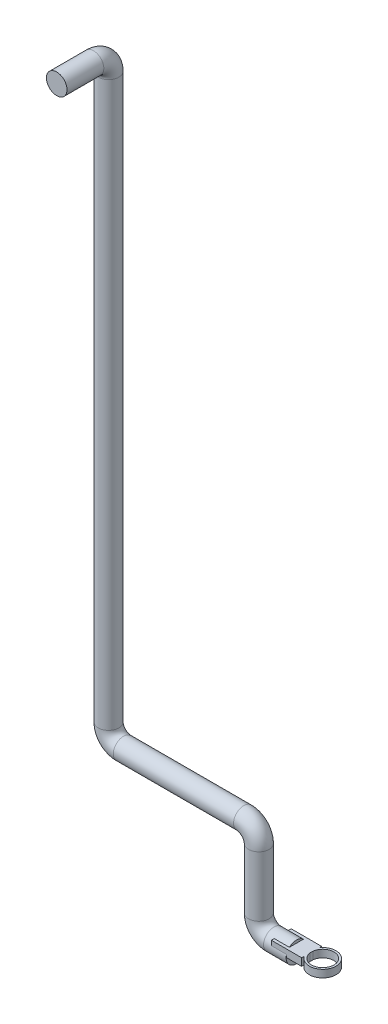
ISO-10303-21;
HEADER;
FILE_DESCRIPTION(('STEP AP214'),'2;1');
FILE_NAME('part.step','',(''),(''),'','','');
FILE_SCHEMA(('AUTOMOTIVE_DESIGN { 1 0 10303 214 1 1 1 1 }'));
ENDSEC;
DATA;
#1=APPLICATION_CONTEXT('core data for automotive mechanical design processes');
#2=APPLICATION_PROTOCOL_DEFINITION('international standard','automotive_design',2000,#1);
#3=PRODUCT_CONTEXT('',#1,'mechanical');
#4=PRODUCT('Part','Part','',(#3));
#5=PRODUCT_RELATED_PRODUCT_CATEGORY('part','',(#4));
#6=PRODUCT_DEFINITION_FORMATION('','',#4);
#7=PRODUCT_DEFINITION_CONTEXT('part definition',#1,'design');
#8=PRODUCT_DEFINITION('design','',#6,#7);
#9=PRODUCT_DEFINITION_SHAPE('','',#8);
#10=(LENGTH_UNIT() NAMED_UNIT(*) SI_UNIT(.MILLI.,.METRE.));
#11=(NAMED_UNIT(*) PLANE_ANGLE_UNIT() SI_UNIT($,.RADIAN.));
#12=(NAMED_UNIT(*) SI_UNIT($,.STERADIAN.) SOLID_ANGLE_UNIT());
#13=UNCERTAINTY_MEASURE_WITH_UNIT(LENGTH_MEASURE(1.E-05),#10,'distance_accuracy_value','');
#14=(GEOMETRIC_REPRESENTATION_CONTEXT(3) GLOBAL_UNCERTAINTY_ASSIGNED_CONTEXT((#13)) GLOBAL_UNIT_ASSIGNED_CONTEXT((#10,
#11,#12)) REPRESENTATION_CONTEXT('',''));
#15=CARTESIAN_POINT('',(0.,0.,0.));
#16=DIRECTION('',(0.,0.,1.));
#17=DIRECTION('',(1.,0.,0.));
#18=AXIS2_PLACEMENT_3D('',#15,#16,#17);
#19=CARTESIAN_POINT('',(20.1474570768367,10.,-13.1948239833502));
#20=DIRECTION('',(-1.,0.,0.));
#21=DIRECTION('',(0.,0.,1.));
#22=AXIS2_PLACEMENT_3D('',#19,#20,#21);
#23=PLANE('',#22);
#24=DIRECTION('',(0.,-1.,0.));
#25=VECTOR('',#24,1.);
#26=CARTESIAN_POINT('',(20.1474570768367,10.,-9.74217306553213));
#27=LINE('',#26,#25);
#28=CARTESIAN_POINT('',(20.1474570768367,0.,-9.74217306553213));
#29=VERTEX_POINT('',#28);
#30=CARTESIAN_POINT('',(20.1474570768367,10.,-9.74217306553213));
#31=VERTEX_POINT('',#30);
#32=EDGE_CURVE('E146',#29,#31,#27,.F.);
#33=ORIENTED_EDGE('',*,*,#32,.F.);
#34=DIRECTION('',(0.,0.,-1.));
#35=VECTOR('',#34,1.);
#36=CARTESIAN_POINT('',(20.1474570768367,0.,-13.1948239833502));
#37=LINE('',#36,#35);
#38=CARTESIAN_POINT('',(20.1474570768367,0.,-13.1948239833502));
#39=VERTEX_POINT('',#38);
#40=EDGE_CURVE('E161',#29,#39,#37,.T.);
#41=ORIENTED_EDGE('',*,*,#40,.T.);
#42=DIRECTION('',(0.,-1.,0.));
#43=VECTOR('',#42,1.);
#44=CARTESIAN_POINT('',(20.1474570768367,10.,-13.1948239833502));
#45=LINE('',#44,#43);
#46=CARTESIAN_POINT('',(20.1474570768367,10.,-13.1948239833502));
#47=VERTEX_POINT('',#46);
#48=EDGE_CURVE('E173',#47,#39,#45,.T.);
#49=ORIENTED_EDGE('',*,*,#48,.F.);
#50=DIRECTION('',(0.,0.,-1.));
#51=VECTOR('',#50,1.);
#52=CARTESIAN_POINT('',(20.1474570768367,10.,-13.1948239833502));
#53=LINE('',#52,#51);
#54=EDGE_CURVE('E139',#31,#47,#53,.T.);
#55=ORIENTED_EDGE('',*,*,#54,.F.);
#56=EDGE_LOOP('',(#33,#41,#49,#55));
#57=FACE_BOUND('',#56,.T.);
#58=ADVANCED_FACE('F34',(#57),#23,.F.);
#59=DIRECTION('',(0.,-1.,0.));
#60=VECTOR('',#59,1.);
#61=CARTESIAN_POINT('',(20.1474570768367,10.,9.74217306553213));
#62=LINE('',#61,#60);
#63=CARTESIAN_POINT('',(20.1474570768367,10.,9.74217306553213));
#64=VERTEX_POINT('',#63);
#65=CARTESIAN_POINT('',(20.1474570768367,0.,9.74217306553213));
#66=VERTEX_POINT('',#65);
#67=EDGE_CURVE('E499',#64,#66,#62,.T.);
#68=ORIENTED_EDGE('',*,*,#67,.F.);
#69=CARTESIAN_POINT('',(20.1474570768367,10.,13.1948239833502));
#70=VERTEX_POINT('',#69);
#71=EDGE_CURVE('E138',#70,#64,#53,.T.);
#72=ORIENTED_EDGE('',*,*,#71,.F.);
#73=DIRECTION('',(0.,-1.,0.));
#74=VECTOR('',#73,1.);
#75=CARTESIAN_POINT('',(20.1474570768367,10.,13.1948239833502));
#76=LINE('',#75,#74);
#77=CARTESIAN_POINT('',(20.1474570768367,0.,13.1948239833502));
#78=VERTEX_POINT('',#77);
#79=EDGE_CURVE('E155',#70,#78,#76,.T.);
#80=ORIENTED_EDGE('',*,*,#79,.T.);
#81=EDGE_CURVE('E156',#78,#66,#37,.T.);
#82=ORIENTED_EDGE('',*,*,#81,.T.);
#83=EDGE_LOOP('',(#68,#72,#80,#82));
#84=FACE_BOUND('',#83,.T.);
#85=ADVANCED_FACE('F270',(#84),#23,.F.);
#86=CARTESIAN_POINT('',(0.,0.,0.));
#87=DIRECTION('',(1.,0.,0.));
#88=DIRECTION('',(0.,0.,-1.));
#89=AXIS2_PLACEMENT_3D('',#86,#87,#88);
#90=PLANE('',#89);
#91=CARTESIAN_POINT('',(0.,0.,0.));
#92=DIRECTION('',(1.,0.,0.));
#93=DIRECTION('',(0.,0.,-1.));
#94=AXIS2_PLACEMENT_3D('',#91,#92,#93);
#95=CIRCLE('',#94,13.7);
#96=CARTESIAN_POINT('',(0.,0.,-13.7));
#97=VERTEX_POINT('',#96);
#98=CARTESIAN_POINT('',(0.,3.6860032621264,-13.1948239833502));
#99=VERTEX_POINT('',#98);
#100=EDGE_CURVE('E185',#97,#99,#95,.T.);
#101=ORIENTED_EDGE('',*,*,#100,.T.);
#102=DIRECTION('',(0.,-1.,0.));
#103=VECTOR('',#102,1.);
#104=CARTESIAN_POINT('',(0.,0.,-13.1948239833502));
#105=LINE('',#104,#103);
#106=CARTESIAN_POINT('',(0.,0.,-13.1948239833502));
#107=VERTEX_POINT('',#106);
#108=EDGE_CURVE('E181',#99,#107,#105,.T.);
#109=ORIENTED_EDGE('',*,*,#108,.T.);
#110=DIRECTION('',(0.,0.,1.));
#111=VECTOR('',#110,1.);
#112=CARTESIAN_POINT('',(0.,0.,0.));
#113=LINE('',#112,#111);
#114=CARTESIAN_POINT('',(0.,0.,13.1948239833502));
#115=VERTEX_POINT('',#114);
#116=EDGE_CURVE('E11',#107,#115,#113,.T.);
#117=ORIENTED_EDGE('',*,*,#116,.T.);
#118=DIRECTION('',(0.,1.,0.));
#119=VECTOR('',#118,1.);
#120=CARTESIAN_POINT('',(0.,0.,13.1948239833502));
#121=LINE('',#120,#119);
#122=CARTESIAN_POINT('',(0.,3.68600326212638,13.1948239833502));
#123=VERTEX_POINT('',#122);
#124=EDGE_CURVE('E178',#115,#123,#121,.T.);
#125=ORIENTED_EDGE('',*,*,#124,.T.);
#126=EDGE_CURVE('E190',#123,#97,#95,.T.);
#127=ORIENTED_EDGE('',*,*,#126,.T.);
#128=EDGE_LOOP('',(#101,#109,#117,#125,#127));
#129=FACE_BOUND('',#128,.T.);
#130=ADVANCED_FACE('F245',(#129),#90,.T.);
#131=CARTESIAN_POINT('',(0.,0.,0.));
#132=DIRECTION('',(-1.,0.,0.));
#133=DIRECTION('',(0.,0.,1.));
#134=AXIS2_PLACEMENT_3D('',#131,#132,#133);
#135=CYLINDRICAL_SURFACE('',#134,13.7);
#136=CARTESIAN_POINT('',(-30.,0.,0.));
#137=DIRECTION('',(1.,0.,0.));
#138=DIRECTION('',(0.,0.,-1.));
#139=AXIS2_PLACEMENT_3D('',#136,#137,#138);
#140=CIRCLE('',#139,13.7);
#141=CARTESIAN_POINT('',(-30.,-13.7,0.));
#142=VERTEX_POINT('',#141);
#143=EDGE_CURVE('E188',#142,#142,#140,.T.);
#144=ORIENTED_EDGE('',*,*,#143,.T.);
#145=EDGE_LOOP('',(#144));
#146=FACE_BOUND('',#145,.T.);
#147=DIRECTION('',(-1.,0.,0.));
#148=VECTOR('',#147,1.);
#149=CARTESIAN_POINT('',(0.,3.6860032621264,-13.1948239833502));
#150=LINE('',#149,#148);
#151=CARTESIAN_POINT('',(-20.1474570768367,3.6860032621264,-13.1948239833502));
#152=VERTEX_POINT('',#151);
#153=EDGE_CURVE('E42',#99,#152,#150,.T.);
#154=ORIENTED_EDGE('',*,*,#153,.F.);
#155=ORIENTED_EDGE('',*,*,#100,.F.);
#156=ORIENTED_EDGE('',*,*,#126,.F.);
#157=DIRECTION('',(-1.,0.,0.));
#158=VECTOR('',#157,1.);
#159=CARTESIAN_POINT('',(0.,3.68600326212638,13.1948239833502));
#160=LINE('',#159,#158);
#161=CARTESIAN_POINT('',(-20.1474570768367,3.68600326212638,13.1948239833502));
#162=VERTEX_POINT('',#161);
#163=EDGE_CURVE('E221',#162,#123,#160,.F.);
#164=ORIENTED_EDGE('',*,*,#163,.F.);
#165=CARTESIAN_POINT('',(-20.1474570768367,0.,0.));
#166=DIRECTION('',(1.,0.,0.));
#167=DIRECTION('',(0.,0.,-1.));
#168=AXIS2_PLACEMENT_3D('',#165,#166,#167);
#169=CIRCLE('',#168,13.7);
#170=CARTESIAN_POINT('',(-20.1474570768367,10.,9.36429388688758));
#171=VERTEX_POINT('',#170);
#172=EDGE_CURVE('E219',#171,#162,#169,.T.);
#173=ORIENTED_EDGE('',*,*,#172,.F.);
#174=DIRECTION('',(-1.,0.,0.));
#175=VECTOR('',#174,1.);
#176=CARTESIAN_POINT('',(0.,10.,9.36429388688757));
#177=LINE('',#176,#175);
#178=CARTESIAN_POINT('',(0.,10.,9.36429388688757));
#179=VERTEX_POINT('',#178);
#180=EDGE_CURVE('E214',#171,#179,#177,.F.);
#181=ORIENTED_EDGE('',*,*,#180,.T.);
#182=CARTESIAN_POINT('',(0.,10.,-9.36429388688757));
#183=VERTEX_POINT('',#182);
#184=EDGE_CURVE('E189',#183,#179,#95,.T.);
#185=ORIENTED_EDGE('',*,*,#184,.F.);
#186=DIRECTION('',(-1.,0.,0.));
#187=VECTOR('',#186,1.);
#188=CARTESIAN_POINT('',(0.,10.,-9.36429388688757));
#189=LINE('',#188,#187);
#190=CARTESIAN_POINT('',(-20.1474570768367,10.,-9.36429388688757));
#191=VERTEX_POINT('',#190);
#192=EDGE_CURVE('E224',#183,#191,#189,.T.);
#193=ORIENTED_EDGE('',*,*,#192,.T.);
#194=EDGE_CURVE('E222',#152,#191,#169,.T.);
#195=ORIENTED_EDGE('',*,*,#194,.F.);
#196=EDGE_LOOP('',(#154,#155,#156,#164,#173,#181,#185,#193,#195));
#197=FACE_BOUND('',#196,.T.);
#198=ADVANCED_FACE('F238',(#146,#197),#135,.T.);
#199=DIRECTION('',(0.,0.,1.));
#200=VECTOR('',#199,1.);
#201=CARTESIAN_POINT('',(0.,10.,0.));
#202=LINE('',#201,#200);
#203=EDGE_CURVE('E176',#183,#179,#202,.T.);
#204=ORIENTED_EDGE('',*,*,#203,.F.);
#205=ORIENTED_EDGE('',*,*,#184,.T.);
#206=EDGE_LOOP('',(#204,#205));
#207=FACE_BOUND('',#206,.T.);
#208=ADVANCED_FACE('F36',(#207),#90,.T.);
#209=CARTESIAN_POINT('',(-30.,20.,0.));
#210=DIRECTION('',(0.,0.,-1.));
#211=DIRECTION('',(-1.,0.,0.));
#212=AXIS2_PLACEMENT_3D('',#209,#210,#211);
#213=TOROIDAL_SURFACE('',#212,20.,13.7);
#214=CARTESIAN_POINT('',(-50.,20.,0.));
#215=DIRECTION('',(0.,-1.,0.));
#216=DIRECTION('',(0.,0.,-1.));
#217=AXIS2_PLACEMENT_3D('',#214,#215,#216);
#218=CIRCLE('',#217,13.7);
#219=CARTESIAN_POINT('',(-63.7,20.,0.));
#220=VERTEX_POINT('',#219);
#221=EDGE_CURVE('E193',#220,#220,#218,.T.);
#222=CARTESIAN_POINT('',(-30.,20.,0.));
#223=DIRECTION('',(0.,0.,-1.));
#224=DIRECTION('',(-1.,0.,0.));
#225=AXIS2_PLACEMENT_3D('',#222,#223,#224);
#226=CIRCLE('',#225,33.7);
#227=EDGE_CURVE('',#142,#220,#226,.T.);
#228=ORIENTED_EDGE('',*,*,#143,.F.);
#229=ORIENTED_EDGE('',*,*,#221,.T.);
#230=ORIENTED_EDGE('',*,*,#227,.T.);
#231=ORIENTED_EDGE('',*,*,#227,.F.);
#232=EDGE_LOOP('',(#228,#230,#229,#231));
#233=FACE_BOUND('',#232,.T.);
#234=ADVANCED_FACE('F257',(#233),#213,.T.);
#235=CARTESIAN_POINT('',(-50.,20.,0.));
#236=DIRECTION('',(0.,1.,0.));
#237=DIRECTION('',(0.,0.,1.));
#238=AXIS2_PLACEMENT_3D('',#235,#236,#237);
#239=CYLINDRICAL_SURFACE('',#238,13.7);
#240=CARTESIAN_POINT('',(-50.,100.,0.));
#241=DIRECTION('',(0.,-1.,0.));
#242=DIRECTION('',(0.,0.,-1.));
#243=AXIS2_PLACEMENT_3D('',#240,#241,#242);
#244=CIRCLE('',#243,13.7);
#245=CARTESIAN_POINT('',(-36.3,100.,0.));
#246=VERTEX_POINT('',#245);
#247=EDGE_CURVE('E196',#246,#246,#244,.T.);
#248=ORIENTED_EDGE('',*,*,#247,.T.);
#249=EDGE_LOOP('',(#248));
#250=FACE_BOUND('',#249,.T.);
#251=ORIENTED_EDGE('',*,*,#221,.F.);
#252=EDGE_LOOP('',(#251));
#253=FACE_BOUND('',#252,.T.);
#254=ADVANCED_FACE('F263',(#250,#253),#239,.T.);
#255=CARTESIAN_POINT('',(-70.,100.,0.));
#256=DIRECTION('',(0.,0.,1.));
#257=DIRECTION('',(1.,0.,0.));
#258=AXIS2_PLACEMENT_3D('',#255,#256,#257);
#259=TOROIDAL_SURFACE('',#258,20.,13.7);
#260=CARTESIAN_POINT('',(-70.,120.,0.));
#261=DIRECTION('',(1.,0.,0.));
#262=DIRECTION('',(0.,0.,-1.));
#263=AXIS2_PLACEMENT_3D('',#260,#261,#262);
#264=CIRCLE('',#263,13.7);
#265=CARTESIAN_POINT('',(-70.,133.7,0.));
#266=VERTEX_POINT('',#265);
#267=EDGE_CURVE('E199',#266,#266,#264,.T.);
#268=CARTESIAN_POINT('',(-70.,100.,0.));
#269=DIRECTION('',(0.,0.,1.));
#270=DIRECTION('',(1.,0.,0.));
#271=AXIS2_PLACEMENT_3D('',#268,#269,#270);
#272=CIRCLE('',#271,33.7);
#273=EDGE_CURVE('',#246,#266,#272,.T.);
#274=ORIENTED_EDGE('',*,*,#247,.F.);
#275=ORIENTED_EDGE('',*,*,#267,.T.);
#276=ORIENTED_EDGE('',*,*,#273,.T.);
#277=ORIENTED_EDGE('',*,*,#273,.F.);
#278=EDGE_LOOP('',(#274,#276,#275,#277));
#279=FACE_BOUND('',#278,.T.);
#280=ADVANCED_FACE('F418',(#279),#259,.T.);
#281=CARTESIAN_POINT('',(-70.,120.,0.));
#282=DIRECTION('',(-1.,0.,0.));
#283=DIRECTION('',(0.,-1.,0.));
#284=AXIS2_PLACEMENT_3D('',#281,#282,#283);
#285=CYLINDRICAL_SURFACE('',#284,13.7);
#286=CARTESIAN_POINT('',(-230.,120.,0.));
#287=DIRECTION('',(1.,0.,0.));
#288=DIRECTION('',(0.,0.,-1.));
#289=AXIS2_PLACEMENT_3D('',#286,#287,#288);
#290=CIRCLE('',#289,13.7);
#291=CARTESIAN_POINT('',(-230.,106.3,0.));
#292=VERTEX_POINT('',#291);
#293=EDGE_CURVE('E202',#292,#292,#290,.T.);
#294=ORIENTED_EDGE('',*,*,#293,.T.);
#295=EDGE_LOOP('',(#294));
#296=FACE_BOUND('',#295,.T.);
#297=ORIENTED_EDGE('',*,*,#267,.F.);
#298=EDGE_LOOP('',(#297));
#299=FACE_BOUND('',#298,.T.);
#300=ADVANCED_FACE('F408',(#296,#299),#285,.T.);
#301=CARTESIAN_POINT('',(-230.,140.,0.));
#302=DIRECTION('',(0.,0.,-1.));
#303=DIRECTION('',(-1.,0.,0.));
#304=AXIS2_PLACEMENT_3D('',#301,#302,#303);
#305=TOROIDAL_SURFACE('',#304,20.,13.7);
#306=CARTESIAN_POINT('',(-250.,140.,0.));
#307=DIRECTION('',(0.,-1.,0.));
#308=DIRECTION('',(0.,0.,-1.));
#309=AXIS2_PLACEMENT_3D('',#306,#307,#308);
#310=CIRCLE('',#309,13.7);
#311=CARTESIAN_POINT('',(-263.7,140.,0.));
#312=VERTEX_POINT('',#311);
#313=EDGE_CURVE('E205',#312,#312,#310,.T.);
#314=CARTESIAN_POINT('',(-230.,140.,0.));
#315=DIRECTION('',(0.,0.,-1.));
#316=DIRECTION('',(-1.,0.,0.));
#317=AXIS2_PLACEMENT_3D('',#314,#315,#316);
#318=CIRCLE('',#317,33.7);
#319=EDGE_CURVE('',#292,#312,#318,.T.);
#320=ORIENTED_EDGE('',*,*,#293,.F.);
#321=ORIENTED_EDGE('',*,*,#313,.T.);
#322=ORIENTED_EDGE('',*,*,#319,.T.);
#323=ORIENTED_EDGE('',*,*,#319,.F.);
#324=EDGE_LOOP('',(#320,#322,#321,#323));
#325=FACE_BOUND('',#324,.T.);
#326=ADVANCED_FACE('F398',(#325),#305,.T.);
#327=CARTESIAN_POINT('',(-250.,140.,0.));
#328=DIRECTION('',(0.,1.,0.));
#329=DIRECTION('',(-1.,0.,0.));
#330=AXIS2_PLACEMENT_3D('',#327,#328,#329);
#331=CYLINDRICAL_SURFACE('',#330,13.7);
#332=CARTESIAN_POINT('',(-250.,890.,0.));
#333=DIRECTION('',(0.,-1.,0.));
#334=DIRECTION('',(0.,0.,-1.));
#335=AXIS2_PLACEMENT_3D('',#332,#333,#334);
#336=CIRCLE('',#335,13.7);
#337=CARTESIAN_POINT('',(-250.,890.,-13.7));
#338=VERTEX_POINT('',#337);
#339=EDGE_CURVE('E208',#338,#338,#336,.T.);
#340=ORIENTED_EDGE('',*,*,#339,.T.);
#341=EDGE_LOOP('',(#340));
#342=FACE_BOUND('',#341,.T.);
#343=ORIENTED_EDGE('',*,*,#313,.F.);
#344=EDGE_LOOP('',(#343));
#345=FACE_BOUND('',#344,.T.);
#346=ADVANCED_FACE('F388',(#342,#345),#331,.T.);
#347=CARTESIAN_POINT('',(-250.,890.,20.));
#348=DIRECTION('',(1.,0.,0.));
#349=DIRECTION('',(0.,0.,-1.));
#350=AXIS2_PLACEMENT_3D('',#347,#348,#349);
#351=TOROIDAL_SURFACE('',#350,20.,13.7);
#352=CARTESIAN_POINT('',(-250.,910.,20.));
#353=DIRECTION('',(0.,0.,-1.));
#354=DIRECTION('',(0.,1.,0.));
#355=AXIS2_PLACEMENT_3D('',#352,#353,#354);
#356=CIRCLE('',#355,13.7);
#357=CARTESIAN_POINT('',(-250.,923.7,20.));
#358=VERTEX_POINT('',#357);
#359=EDGE_CURVE('E211',#358,#358,#356,.T.);
#360=CARTESIAN_POINT('',(-250.,890.,20.));
#361=DIRECTION('',(1.,0.,0.));
#362=DIRECTION('',(0.,0.,-1.));
#363=AXIS2_PLACEMENT_3D('',#360,#361,#362);
#364=CIRCLE('',#363,33.7);
#365=EDGE_CURVE('',#338,#358,#364,.T.);
#366=ORIENTED_EDGE('',*,*,#339,.F.);
#367=ORIENTED_EDGE('',*,*,#359,.T.);
#368=ORIENTED_EDGE('',*,*,#365,.T.);
#369=ORIENTED_EDGE('',*,*,#365,.F.);
#370=EDGE_LOOP('',(#366,#368,#367,#369));
#371=FACE_BOUND('',#370,.T.);
#372=ADVANCED_FACE('F379',(#371),#351,.T.);
#373=CARTESIAN_POINT('',(-250.,910.,20.));
#374=DIRECTION('',(0.,0.,1.));
#375=DIRECTION('',(1.,0.,0.));
#376=AXIS2_PLACEMENT_3D('',#373,#374,#375);
#377=CYLINDRICAL_SURFACE('',#376,13.7);
#378=CARTESIAN_POINT('',(-250.,910.,69.));
#379=DIRECTION('',(0.,0.,-1.));
#380=DIRECTION('',(-1.,0.,0.));
#381=AXIS2_PLACEMENT_3D('',#378,#379,#380);
#382=CIRCLE('',#381,13.7);
#383=CARTESIAN_POINT('',(-263.7,910.,69.));
#384=VERTEX_POINT('',#383);
#385=EDGE_CURVE('E184',#384,#384,#382,.T.);
#386=ORIENTED_EDGE('',*,*,#385,.T.);
#387=EDGE_LOOP('',(#386));
#388=FACE_BOUND('',#387,.T.);
#389=ORIENTED_EDGE('',*,*,#359,.F.);
#390=EDGE_LOOP('',(#389));
#391=FACE_BOUND('',#390,.T.);
#392=ADVANCED_FACE('F268',(#388,#391),#377,.T.);
#393=CARTESIAN_POINT('',(0.,0.,69.));
#394=DIRECTION('',(0.,0.,-1.));
#395=DIRECTION('',(-1.,0.,0.));
#396=AXIS2_PLACEMENT_3D('',#393,#394,#395);
#397=PLANE('',#396);
#398=ORIENTED_EDGE('',*,*,#385,.F.);
#399=EDGE_LOOP('',(#398));
#400=FACE_BOUND('',#399,.T.);
#401=ADVANCED_FACE('F258',(#400),#397,.F.);
#402=CARTESIAN_POINT('',(-20.1474570768367,10.,-13.1948239833502));
#403=DIRECTION('',(1.,0.,0.));
#404=DIRECTION('',(0.,0.,-1.));
#405=AXIS2_PLACEMENT_3D('',#402,#403,#404);
#406=PLANE('',#405);
#407=DIRECTION('',(0.,-1.,0.));
#408=VECTOR('',#407,1.);
#409=CARTESIAN_POINT('',(-20.1474570768367,10.,-13.1948239833502));
#410=LINE('',#409,#408);
#411=CARTESIAN_POINT('',(-20.1474570768367,10.,-13.1948239833502));
#412=VERTEX_POINT('',#411);
#413=EDGE_CURVE('E170',#412,#152,#410,.T.);
#414=ORIENTED_EDGE('',*,*,#413,.T.);
#415=ORIENTED_EDGE('',*,*,#194,.T.);
#416=DIRECTION('',(0.,0.,1.));
#417=VECTOR('',#416,1.);
#418=CARTESIAN_POINT('',(-20.1474570768367,10.,-13.1948239833502));
#419=LINE('',#418,#417);
#420=EDGE_CURVE('E150',#412,#191,#419,.T.);
#421=ORIENTED_EDGE('',*,*,#420,.F.);
#422=EDGE_LOOP('',(#414,#415,#421));
#423=FACE_BOUND('',#422,.T.);
#424=ADVANCED_FACE('F232',(#423),#406,.F.);
#425=CARTESIAN_POINT('',(0.,10.,0.));
#426=DIRECTION('',(0.,1.,0.));
#427=DIRECTION('',(0.,0.,1.));
#428=AXIS2_PLACEMENT_3D('',#425,#426,#427);
#429=PLANE('',#428);
#430=ORIENTED_EDGE('',*,*,#71,.T.);
#431=CARTESIAN_POINT('',(35.,10.,0.));
#432=DIRECTION('',(0.,1.,0.));
#433=DIRECTION('',(0.,0.,1.));
#434=AXIS2_PLACEMENT_3D('',#431,#432,#433);
#435=CIRCLE('',#434,17.7625439428925);
#436=EDGE_CURVE('E129',#64,#31,#435,.T.);
#437=ORIENTED_EDGE('',*,*,#436,.T.);
#438=ORIENTED_EDGE('',*,*,#54,.T.);
#439=DIRECTION('',(-1.,0.,0.));
#440=VECTOR('',#439,1.);
#441=CARTESIAN_POINT('',(-20.1474570768367,10.,-13.1948239833502));
#442=LINE('',#441,#440);
#443=EDGE_CURVE('E142',#47,#412,#442,.T.);
#444=ORIENTED_EDGE('',*,*,#443,.T.);
#445=ORIENTED_EDGE('',*,*,#420,.T.);
#446=ORIENTED_EDGE('',*,*,#192,.F.);
#447=ORIENTED_EDGE('',*,*,#203,.T.);
#448=ORIENTED_EDGE('',*,*,#180,.F.);
#449=CARTESIAN_POINT('',(-20.1474570768367,10.,13.1948239833502));
#450=VERTEX_POINT('',#449);
#451=EDGE_CURVE('E149',#171,#450,#419,.T.);
#452=ORIENTED_EDGE('',*,*,#451,.T.);
#453=DIRECTION('',(1.,0.,0.));
#454=VECTOR('',#453,1.);
#455=CARTESIAN_POINT('',(-20.1474570768367,10.,13.1948239833502));
#456=LINE('',#455,#454);
#457=EDGE_CURVE('E153',#450,#70,#456,.T.);
#458=ORIENTED_EDGE('',*,*,#457,.T.);
#459=EDGE_LOOP('',(#430,#437,#438,#444,#445,#446,#447,#448,#452,#458));
#460=FACE_BOUND('',#459,.T.);
#461=CARTESIAN_POINT('',(20.1474570768367,10.,2.09808691802619));
#462=VERTEX_POINT('',#461);
#463=CARTESIAN_POINT('',(20.1474570768367,10.,-2.09808691802619));
#464=VERTEX_POINT('',#463);
#465=EDGE_CURVE('E134',#462,#464,#53,.T.);
#466=ORIENTED_EDGE('',*,*,#465,.T.);
#467=CARTESIAN_POINT('',(35.,10.,0.));
#468=DIRECTION('',(0.,1.,0.));
#469=DIRECTION('',(0.,0.,1.));
#470=AXIS2_PLACEMENT_3D('',#467,#468,#469);
#471=CIRCLE('',#470,15.);
#472=EDGE_CURVE('E49',#462,#464,#471,.T.);
#473=ORIENTED_EDGE('',*,*,#472,.F.);
#474=EDGE_LOOP('',(#466,#473));
#475=FACE_BOUND('',#474,.T.);
#476=ADVANCED_FACE('F133',(#460,#475),#429,.T.);
#477=CARTESIAN_POINT('',(20.1474570768367,0.,2.09808691802619));
#478=VERTEX_POINT('',#477);
#479=CARTESIAN_POINT('',(20.1474570768367,0.,-2.09808691802619));
#480=VERTEX_POINT('',#479);
#481=EDGE_CURVE('E160',#478,#480,#37,.T.);
#482=ORIENTED_EDGE('',*,*,#481,.T.);
#483=DIRECTION('',(0.,-1.,0.));
#484=VECTOR('',#483,1.);
#485=CARTESIAN_POINT('',(20.1474570768367,10.,-2.09808691802619));
#486=LINE('',#485,#484);
#487=EDGE_CURVE('E128',#480,#464,#486,.F.);
#488=ORIENTED_EDGE('',*,*,#487,.T.);
#489=ORIENTED_EDGE('',*,*,#465,.F.);
#490=DIRECTION('',(0.,-1.,0.));
#491=VECTOR('',#490,1.);
#492=CARTESIAN_POINT('',(20.1474570768367,10.,2.09808691802619));
#493=LINE('',#492,#491);
#494=EDGE_CURVE('E122',#462,#478,#493,.T.);
#495=ORIENTED_EDGE('',*,*,#494,.T.);
#496=EDGE_LOOP('',(#482,#488,#489,#495));
#497=FACE_BOUND('',#496,.T.);
#498=ADVANCED_FACE('F137',(#497),#23,.F.);
#499=CARTESIAN_POINT('',(-20.1474570768367,10.,-13.1948239833502));
#500=DIRECTION('',(0.,0.,1.));
#501=DIRECTION('',(1.,0.,0.));
#502=AXIS2_PLACEMENT_3D('',#499,#500,#501);
#503=PLANE('',#502);
#504=ORIENTED_EDGE('',*,*,#108,.F.);
#505=ORIENTED_EDGE('',*,*,#153,.T.);
#506=ORIENTED_EDGE('',*,*,#413,.F.);
#507=ORIENTED_EDGE('',*,*,#443,.F.);
#508=ORIENTED_EDGE('',*,*,#48,.T.);
#509=DIRECTION('',(-1.,0.,0.));
#510=VECTOR('',#509,1.);
#511=CARTESIAN_POINT('',(-20.1474570768367,0.,-13.1948239833502));
#512=LINE('',#511,#510);
#513=EDGE_CURVE('E159',#39,#107,#512,.T.);
#514=ORIENTED_EDGE('',*,*,#513,.T.);
#515=EDGE_LOOP('',(#504,#505,#506,#507,#508,#514));
#516=FACE_BOUND('',#515,.T.);
#517=ADVANCED_FACE('F284',(#516),#503,.F.);
#518=ORIENTED_EDGE('',*,*,#451,.F.);
#519=ORIENTED_EDGE('',*,*,#172,.T.);
#520=DIRECTION('',(0.,-1.,0.));
#521=VECTOR('',#520,1.);
#522=CARTESIAN_POINT('',(-20.1474570768367,10.,13.1948239833502));
#523=LINE('',#522,#521);
#524=EDGE_CURVE('E167',#450,#162,#523,.T.);
#525=ORIENTED_EDGE('',*,*,#524,.F.);
#526=EDGE_LOOP('',(#518,#519,#525));
#527=FACE_BOUND('',#526,.T.);
#528=ADVANCED_FACE('F255',(#527),#406,.F.);
#529=CARTESIAN_POINT('',(-20.1474570768367,10.,13.1948239833502));
#530=DIRECTION('',(0.,0.,-1.));
#531=DIRECTION('',(-1.,0.,0.));
#532=AXIS2_PLACEMENT_3D('',#529,#530,#531);
#533=PLANE('',#532);
#534=ORIENTED_EDGE('',*,*,#124,.F.);
#535=DIRECTION('',(1.,0.,0.));
#536=VECTOR('',#535,1.);
#537=CARTESIAN_POINT('',(-20.1474570768367,0.,13.1948239833502));
#538=LINE('',#537,#536);
#539=EDGE_CURVE('E143',#115,#78,#538,.T.);
#540=ORIENTED_EDGE('',*,*,#539,.T.);
#541=ORIENTED_EDGE('',*,*,#79,.F.);
#542=ORIENTED_EDGE('',*,*,#457,.F.);
#543=ORIENTED_EDGE('',*,*,#524,.T.);
#544=ORIENTED_EDGE('',*,*,#163,.T.);
#545=EDGE_LOOP('',(#534,#540,#541,#542,#543,#544));
#546=FACE_BOUND('',#545,.T.);
#547=ADVANCED_FACE('F248',(#546),#533,.F.);
#548=CARTESIAN_POINT('',(0.,0.,0.));
#549=DIRECTION('',(0.,1.,0.));
#550=DIRECTION('',(0.,0.,1.));
#551=AXIS2_PLACEMENT_3D('',#548,#549,#550);
#552=PLANE('',#551);
#553=ORIENTED_EDGE('',*,*,#481,.F.);
#554=CARTESIAN_POINT('',(35.,0.,0.));
#555=DIRECTION('',(0.,1.,0.));
#556=DIRECTION('',(0.,0.,1.));
#557=AXIS2_PLACEMENT_3D('',#554,#555,#556);
#558=CIRCLE('',#557,15.);
#559=EDGE_CURVE('E54',#478,#480,#558,.T.);
#560=ORIENTED_EDGE('',*,*,#559,.T.);
#561=EDGE_LOOP('',(#553,#560));
#562=FACE_BOUND('',#561,.T.);
#563=ORIENTED_EDGE('',*,*,#40,.F.);
#564=CARTESIAN_POINT('',(35.,0.,0.));
#565=DIRECTION('',(0.,1.,0.));
#566=DIRECTION('',(0.,0.,1.));
#567=AXIS2_PLACEMENT_3D('',#564,#565,#566);
#568=CIRCLE('',#567,17.7625439428925);
#569=EDGE_CURVE('E135',#66,#29,#568,.T.);
#570=ORIENTED_EDGE('',*,*,#569,.F.);
#571=ORIENTED_EDGE('',*,*,#81,.F.);
#572=ORIENTED_EDGE('',*,*,#539,.F.);
#573=ORIENTED_EDGE('',*,*,#116,.F.);
#574=ORIENTED_EDGE('',*,*,#513,.F.);
#575=EDGE_LOOP('',(#563,#570,#571,#572,#573,#574));
#576=FACE_BOUND('',#575,.T.);
#577=ADVANCED_FACE('F298',(#562,#576),#552,.F.);
#578=CARTESIAN_POINT('',(35.,10.,0.));
#579=DIRECTION('',(0.,-1.,0.));
#580=DIRECTION('',(0.,0.,-1.));
#581=AXIS2_PLACEMENT_3D('',#578,#579,#580);
#582=CYLINDRICAL_SURFACE('',#581,17.7625439428925);
#583=ORIENTED_EDGE('',*,*,#569,.T.);
#584=ORIENTED_EDGE('',*,*,#32,.T.);
#585=ORIENTED_EDGE('',*,*,#436,.F.);
#586=ORIENTED_EDGE('',*,*,#67,.T.);
#587=EDGE_LOOP('',(#583,#584,#585,#586));
#588=FACE_BOUND('',#587,.T.);
#589=ADVANCED_FACE('F296',(#588),#582,.T.);
#590=CARTESIAN_POINT('',(35.,10.,0.));
#591=DIRECTION('',(0.,-1.,0.));
#592=DIRECTION('',(0.,0.,-1.));
#593=AXIS2_PLACEMENT_3D('',#590,#591,#592);
#594=CYLINDRICAL_SURFACE('',#593,15.);
#595=ORIENTED_EDGE('',*,*,#487,.F.);
#596=ORIENTED_EDGE('',*,*,#559,.F.);
#597=ORIENTED_EDGE('',*,*,#494,.F.);
#598=ORIENTED_EDGE('',*,*,#472,.T.);
#599=EDGE_LOOP('',(#595,#596,#597,#598));
#600=FACE_BOUND('',#599,.T.);
#601=ADVANCED_FACE('F123',(#600),#594,.F.);
#602=CLOSED_SHELL('',(#58,#85,#130,#198,#208,#234,#254,#280,#300,#326,#346,#372,#392,#401,#424,
#476,#498,#517,#528,#547,#577,#589,#601));
#603=MANIFOLD_SOLID_BREP('B2',#602);
#604=ADVANCED_BREP_SHAPE_REPRESENTATION('',(#18,#603),#14);
#605=SHAPE_DEFINITION_REPRESENTATION(#9,#604);
ENDSEC;
END-ISO-10303-21;
